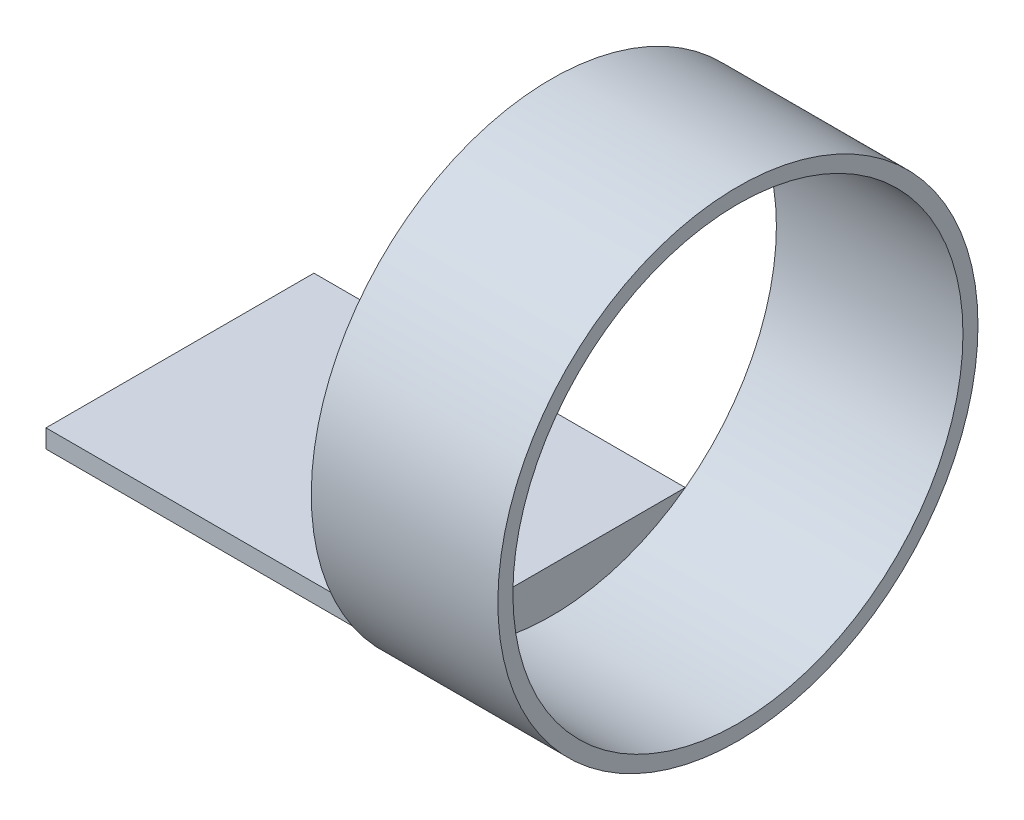
ISO-10303-21;
HEADER;
FILE_DESCRIPTION(('STEP AP214'),'2;1');
FILE_NAME('part.step','',(''),(''),'','','');
FILE_SCHEMA(('AUTOMOTIVE_DESIGN { 1 0 10303 214 1 1 1 1 }'));
ENDSEC;
DATA;
#1=APPLICATION_CONTEXT('core data for automotive mechanical design processes');
#2=APPLICATION_PROTOCOL_DEFINITION('international standard','automotive_design',2000,#1);
#3=PRODUCT_CONTEXT('',#1,'mechanical');
#4=PRODUCT('Part','Part','',(#3));
#5=PRODUCT_RELATED_PRODUCT_CATEGORY('part','',(#4));
#6=PRODUCT_DEFINITION_FORMATION('','',#4);
#7=PRODUCT_DEFINITION_CONTEXT('part definition',#1,'design');
#8=PRODUCT_DEFINITION('design','',#6,#7);
#9=PRODUCT_DEFINITION_SHAPE('','',#8);
#10=(LENGTH_UNIT() NAMED_UNIT(*) SI_UNIT(.MILLI.,.METRE.));
#11=(NAMED_UNIT(*) PLANE_ANGLE_UNIT() SI_UNIT($,.RADIAN.));
#12=(NAMED_UNIT(*) SI_UNIT($,.STERADIAN.) SOLID_ANGLE_UNIT());
#13=UNCERTAINTY_MEASURE_WITH_UNIT(LENGTH_MEASURE(1.E-05),#10,'distance_accuracy_value','');
#14=(GEOMETRIC_REPRESENTATION_CONTEXT(3) GLOBAL_UNCERTAINTY_ASSIGNED_CONTEXT((#13)) GLOBAL_UNIT_ASSIGNED_CONTEXT((#10,
#11,#12)) REPRESENTATION_CONTEXT('',''));
#15=CARTESIAN_POINT('',(0.,0.,0.));
#16=DIRECTION('',(0.,0.,1.));
#17=DIRECTION('',(1.,0.,0.));
#18=AXIS2_PLACEMENT_3D('',#15,#16,#17);
#19=CARTESIAN_POINT('',(0.,0.,0.));
#20=DIRECTION('',(1.,0.,0.));
#21=DIRECTION('',(0.,0.,-1.));
#22=AXIS2_PLACEMENT_3D('',#19,#20,#21);
#23=PLANE('',#22);
#24=DIRECTION('',(0.,1.,0.));
#25=VECTOR('',#24,1.);
#26=CARTESIAN_POINT('',(0.,-20.45,15.1492574075431));
#27=LINE('',#26,#25);
#28=CARTESIAN_POINT('',(0.,-22.5304793557527,15.1492574075431));
#29=VERTEX_POINT('',#28);
#30=CARTESIAN_POINT('',(0.,-20.45,15.1492574075431));
#31=VERTEX_POINT('',#30);
#32=EDGE_CURVE('E57',#29,#31,#27,.T.);
#33=ORIENTED_EDGE('',*,*,#32,.F.);
#34=CARTESIAN_POINT('',(0.,0.,0.));
#35=DIRECTION('',(1.,0.,0.));
#36=DIRECTION('',(0.,0.,-1.));
#37=AXIS2_PLACEMENT_3D('',#34,#35,#36);
#38=CIRCLE('',#37,27.15);
#39=CARTESIAN_POINT('',(0.,-22.5304793557527,-15.1492574075431));
#40=VERTEX_POINT('',#39);
#41=EDGE_CURVE('E43',#40,#29,#38,.T.);
#42=ORIENTED_EDGE('',*,*,#41,.F.);
#43=DIRECTION('',(0.,-1.,0.));
#44=VECTOR('',#43,1.);
#45=CARTESIAN_POINT('',(0.,-20.45,-15.1492574075431));
#46=LINE('',#45,#44);
#47=CARTESIAN_POINT('',(0.,-20.45,-15.1492574075431));
#48=VERTEX_POINT('',#47);
#49=EDGE_CURVE('E63',#48,#40,#46,.T.);
#50=ORIENTED_EDGE('',*,*,#49,.F.);
#51=CARTESIAN_POINT('',(0.,0.,0.));
#52=DIRECTION('',(1.,0.,0.));
#53=DIRECTION('',(0.,0.,-1.));
#54=AXIS2_PLACEMENT_3D('',#51,#52,#53);
#55=CIRCLE('',#54,25.45);
#56=EDGE_CURVE('E131',#48,#31,#55,.T.);
#57=ORIENTED_EDGE('',*,*,#56,.T.);
#58=EDGE_LOOP('',(#33,#42,#50,#57));
#59=FACE_BOUND('',#58,.T.);
#60=ADVANCED_FACE('F39',(#59),#23,.F.);
#61=CARTESIAN_POINT('',(21.1,0.,0.));
#62=DIRECTION('',(-1.,0.,0.));
#63=DIRECTION('',(0.,0.,1.));
#64=AXIS2_PLACEMENT_3D('',#61,#62,#63);
#65=CYLINDRICAL_SURFACE('',#64,27.15);
#66=CARTESIAN_POINT('',(21.1,0.,0.));
#67=DIRECTION('',(1.,0.,0.));
#68=DIRECTION('',(0.,0.,-1.));
#69=AXIS2_PLACEMENT_3D('',#66,#67,#68);
#70=CIRCLE('',#69,27.15);
#71=CARTESIAN_POINT('',(21.1,0.,-27.15));
#72=VERTEX_POINT('',#71);
#73=EDGE_CURVE('E11',#72,#72,#70,.T.);
#74=ORIENTED_EDGE('',*,*,#73,.F.);
#75=EDGE_LOOP('',(#74));
#76=FACE_BOUND('',#75,.T.);
#77=ORIENTED_EDGE('',*,*,#41,.T.);
#78=DIRECTION('',(1.,0.,0.));
#79=VECTOR('',#78,1.);
#80=CARTESIAN_POINT('',(-42.,-22.5304793557527,15.1492574075431));
#81=LINE('',#80,#79);
#82=CARTESIAN_POINT('',(-42.,-22.5304793557527,15.1492574075431));
#83=VERTEX_POINT('',#82);
#84=EDGE_CURVE('E122',#83,#29,#81,.T.);
#85=ORIENTED_EDGE('',*,*,#84,.F.);
#86=CARTESIAN_POINT('',(-42.,0.,0.));
#87=DIRECTION('',(-1.,0.,0.));
#88=DIRECTION('',(0.,0.,-1.));
#89=AXIS2_PLACEMENT_3D('',#86,#87,#88);
#90=CIRCLE('',#89,27.15);
#91=CARTESIAN_POINT('',(-42.,-22.5304793557527,-15.1492574075431));
#92=VERTEX_POINT('',#91);
#93=EDGE_CURVE('E108',#92,#83,#90,.T.);
#94=ORIENTED_EDGE('',*,*,#93,.F.);
#95=DIRECTION('',(1.,0.,0.));
#96=VECTOR('',#95,1.);
#97=CARTESIAN_POINT('',(-42.,-22.5304793557527,-15.1492574075431));
#98=LINE('',#97,#96);
#99=EDGE_CURVE('E103',#92,#40,#98,.T.);
#100=ORIENTED_EDGE('',*,*,#99,.T.);
#101=EDGE_LOOP('',(#77,#85,#94,#100));
#102=FACE_BOUND('',#101,.T.);
#103=ADVANCED_FACE('F41',(#76,#102),#65,.T.);
#104=CARTESIAN_POINT('',(21.1,0.,0.));
#105=DIRECTION('',(1.,0.,0.));
#106=DIRECTION('',(0.,0.,-1.));
#107=AXIS2_PLACEMENT_3D('',#104,#105,#106);
#108=PLANE('',#107);
#109=CARTESIAN_POINT('',(21.1,0.,0.));
#110=DIRECTION('',(1.,0.,0.));
#111=DIRECTION('',(0.,0.,-1.));
#112=AXIS2_PLACEMENT_3D('',#109,#110,#111);
#113=CIRCLE('',#112,25.45);
#114=CARTESIAN_POINT('',(21.1,0.,-25.45));
#115=VERTEX_POINT('',#114);
#116=EDGE_CURVE('E102',#115,#115,#113,.T.);
#117=ORIENTED_EDGE('',*,*,#116,.F.);
#118=EDGE_LOOP('',(#117));
#119=FACE_BOUND('',#118,.T.);
#120=ORIENTED_EDGE('',*,*,#73,.T.);
#121=EDGE_LOOP('',(#120));
#122=FACE_BOUND('',#121,.T.);
#123=ADVANCED_FACE('F148',(#119,#122),#108,.T.);
#124=CARTESIAN_POINT('',(0.,0.,0.));
#125=DIRECTION('',(1.,0.,0.));
#126=DIRECTION('',(0.,0.,-1.));
#127=AXIS2_PLACEMENT_3D('',#124,#125,#126);
#128=CYLINDRICAL_SURFACE('',#127,25.45);
#129=EDGE_CURVE('E127',#31,#48,#55,.T.);
#130=ORIENTED_EDGE('',*,*,#129,.F.);
#131=ORIENTED_EDGE('',*,*,#56,.F.);
#132=EDGE_LOOP('',(#130,#131));
#133=FACE_BOUND('',#132,.T.);
#134=ORIENTED_EDGE('',*,*,#116,.T.);
#135=EDGE_LOOP('',(#134));
#136=FACE_BOUND('',#135,.T.);
#137=ADVANCED_FACE('F139',(#133,#136),#128,.F.);
#138=CARTESIAN_POINT('',(-42.,-20.45,0.));
#139=DIRECTION('',(0.,-1.,0.));
#140=DIRECTION('',(0.,0.,-1.));
#141=AXIS2_PLACEMENT_3D('',#138,#139,#140);
#142=PLANE('',#141);
#143=DIRECTION('',(0.,0.,-1.));
#144=VECTOR('',#143,1.);
#145=CARTESIAN_POINT('',(0.,-20.45,0.));
#146=LINE('',#145,#144);
#147=EDGE_CURVE('E99',#31,#48,#146,.T.);
#148=ORIENTED_EDGE('',*,*,#147,.T.);
#149=DIRECTION('',(1.,0.,0.));
#150=VECTOR('',#149,1.);
#151=CARTESIAN_POINT('',(-42.,-20.45,-15.1492574075431));
#152=LINE('',#151,#150);
#153=CARTESIAN_POINT('',(-42.,-20.45,-15.1492574075431));
#154=VERTEX_POINT('',#153);
#155=EDGE_CURVE('E96',#154,#48,#152,.T.);
#156=ORIENTED_EDGE('',*,*,#155,.F.);
#157=DIRECTION('',(0.,0.,-1.));
#158=VECTOR('',#157,1.);
#159=CARTESIAN_POINT('',(-42.,-20.45,0.));
#160=LINE('',#159,#158);
#161=CARTESIAN_POINT('',(-42.,-20.45,15.1492574075431));
#162=VERTEX_POINT('',#161);
#163=EDGE_CURVE('E82',#162,#154,#160,.T.);
#164=ORIENTED_EDGE('',*,*,#163,.F.);
#165=DIRECTION('',(1.,0.,0.));
#166=VECTOR('',#165,1.);
#167=CARTESIAN_POINT('',(-42.,-20.45,15.1492574075431));
#168=LINE('',#167,#166);
#169=EDGE_CURVE('E113',#162,#31,#168,.T.);
#170=ORIENTED_EDGE('',*,*,#169,.T.);
#171=EDGE_LOOP('',(#148,#156,#164,#170));
#172=FACE_BOUND('',#171,.T.);
#173=ADVANCED_FACE('F97',(#172),#142,.F.);
#174=CARTESIAN_POINT('',(-42.,-20.45,-15.1492574075431));
#175=DIRECTION('',(0.,0.,1.));
#176=DIRECTION('',(1.,0.,0.));
#177=AXIS2_PLACEMENT_3D('',#174,#175,#176);
#178=PLANE('',#177);
#179=ORIENTED_EDGE('',*,*,#49,.T.);
#180=ORIENTED_EDGE('',*,*,#99,.F.);
#181=DIRECTION('',(0.,-1.,0.));
#182=VECTOR('',#181,1.);
#183=CARTESIAN_POINT('',(-42.,-20.45,-15.1492574075431));
#184=LINE('',#183,#182);
#185=EDGE_CURVE('E86',#154,#92,#184,.T.);
#186=ORIENTED_EDGE('',*,*,#185,.F.);
#187=ORIENTED_EDGE('',*,*,#155,.T.);
#188=EDGE_LOOP('',(#179,#180,#186,#187));
#189=FACE_BOUND('',#188,.T.);
#190=ADVANCED_FACE('F105',(#189),#178,.F.);
#191=CARTESIAN_POINT('',(-42.,-20.45,15.1492574075431));
#192=DIRECTION('',(0.,0.,-1.));
#193=DIRECTION('',(-1.,0.,0.));
#194=AXIS2_PLACEMENT_3D('',#191,#192,#193);
#195=PLANE('',#194);
#196=ORIENTED_EDGE('',*,*,#32,.T.);
#197=ORIENTED_EDGE('',*,*,#169,.F.);
#198=DIRECTION('',(0.,1.,0.));
#199=VECTOR('',#198,1.);
#200=CARTESIAN_POINT('',(-42.,-20.45,15.1492574075431));
#201=LINE('',#200,#199);
#202=EDGE_CURVE('E89',#83,#162,#201,.T.);
#203=ORIENTED_EDGE('',*,*,#202,.F.);
#204=ORIENTED_EDGE('',*,*,#84,.T.);
#205=EDGE_LOOP('',(#196,#197,#203,#204));
#206=FACE_BOUND('',#205,.T.);
#207=ADVANCED_FACE('F143',(#206),#195,.F.);
#208=CARTESIAN_POINT('',(-42.,0.,0.));
#209=DIRECTION('',(1.,0.,0.));
#210=DIRECTION('',(0.,0.,-1.));
#211=AXIS2_PLACEMENT_3D('',#208,#209,#210);
#212=PLANE('',#211);
#213=ORIENTED_EDGE('',*,*,#163,.T.);
#214=ORIENTED_EDGE('',*,*,#185,.T.);
#215=ORIENTED_EDGE('',*,*,#93,.T.);
#216=ORIENTED_EDGE('',*,*,#202,.T.);
#217=EDGE_LOOP('',(#213,#214,#215,#216));
#218=FACE_BOUND('',#217,.T.);
#219=ADVANCED_FACE('F84',(#218),#212,.F.);
#220=CARTESIAN_POINT('',(0.,0.,0.));
#221=DIRECTION('',(1.,0.,0.));
#222=DIRECTION('',(0.,0.,-1.));
#223=AXIS2_PLACEMENT_3D('',#220,#221,#222);
#224=PLANE('',#223);
#225=ORIENTED_EDGE('',*,*,#147,.F.);
#226=ORIENTED_EDGE('',*,*,#129,.T.);
#227=EDGE_LOOP('',(#225,#226));
#228=FACE_BOUND('',#227,.T.);
#229=ADVANCED_FACE('F141',(#228),#224,.T.);
#230=CLOSED_SHELL('',(#60,#103,#123,#137,#173,#190,#207,#219,#229));
#231=MANIFOLD_SOLID_BREP('B2',#230);
#232=ADVANCED_BREP_SHAPE_REPRESENTATION('',(#18,#231),#14);
#233=SHAPE_DEFINITION_REPRESENTATION(#9,#232);
ENDSEC;
END-ISO-10303-21;
